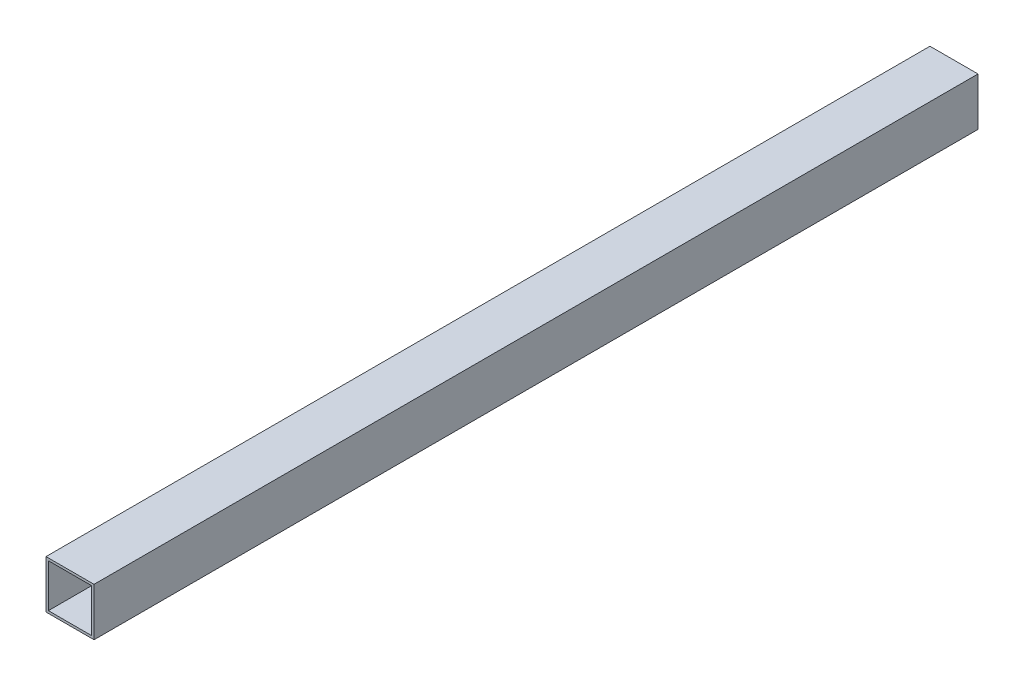
ISO-10303-21;
HEADER;
FILE_DESCRIPTION(('STEP AP214'),'2;1');
FILE_NAME('part.step','',(''),(''),'','','');
FILE_SCHEMA(('AUTOMOTIVE_DESIGN { 1 0 10303 214 1 1 1 1 }'));
ENDSEC;
DATA;
#1=APPLICATION_CONTEXT('core data for automotive mechanical design processes');
#2=APPLICATION_PROTOCOL_DEFINITION('international standard','automotive_design',2000,#1);
#3=PRODUCT_CONTEXT('',#1,'mechanical');
#4=PRODUCT('Part','Part','',(#3));
#5=PRODUCT_RELATED_PRODUCT_CATEGORY('part','',(#4));
#6=PRODUCT_DEFINITION_FORMATION('','',#4);
#7=PRODUCT_DEFINITION_CONTEXT('part definition',#1,'design');
#8=PRODUCT_DEFINITION('design','',#6,#7);
#9=PRODUCT_DEFINITION_SHAPE('','',#8);
#10=(LENGTH_UNIT() NAMED_UNIT(*) SI_UNIT(.MILLI.,.METRE.));
#11=(NAMED_UNIT(*) PLANE_ANGLE_UNIT() SI_UNIT($,.RADIAN.));
#12=(NAMED_UNIT(*) SI_UNIT($,.STERADIAN.) SOLID_ANGLE_UNIT());
#13=UNCERTAINTY_MEASURE_WITH_UNIT(LENGTH_MEASURE(1.E-05),#10,'distance_accuracy_value','');
#14=(GEOMETRIC_REPRESENTATION_CONTEXT(3) GLOBAL_UNCERTAINTY_ASSIGNED_CONTEXT((#13)) GLOBAL_UNIT_ASSIGNED_CONTEXT((#10,
#11,#12)) REPRESENTATION_CONTEXT('',''));
#15=CARTESIAN_POINT('',(0.,0.,0.));
#16=DIRECTION('',(0.,0.,1.));
#17=DIRECTION('',(1.,0.,0.));
#18=AXIS2_PLACEMENT_3D('',#15,#16,#17);
#19=CARTESIAN_POINT('',(0.,0.,920.));
#20=DIRECTION('',(0.,0.,-1.));
#21=DIRECTION('',(-1.,0.,0.));
#22=AXIS2_PLACEMENT_3D('',#19,#20,#21);
#23=PLANE('',#22);
#24=DIRECTION('',(0.,-1.,0.));
#25=VECTOR('',#24,1.);
#26=CARTESIAN_POINT('',(-50.,-50.,920.));
#27=LINE('',#26,#25);
#28=CARTESIAN_POINT('',(-50.,49.9999999999999,920.));
#29=VERTEX_POINT('',#28);
#30=CARTESIAN_POINT('',(-50.,-50.,920.));
#31=VERTEX_POINT('',#30);
#32=EDGE_CURVE('E137',#29,#31,#27,.T.);
#33=ORIENTED_EDGE('',*,*,#32,.T.);
#34=DIRECTION('',(1.,0.,0.));
#35=VECTOR('',#34,1.);
#36=CARTESIAN_POINT('',(-50.,-50.,920.));
#37=LINE('',#36,#35);
#38=CARTESIAN_POINT('',(50.,-50.,920.));
#39=VERTEX_POINT('',#38);
#40=EDGE_CURVE('E141',#31,#39,#37,.T.);
#41=ORIENTED_EDGE('',*,*,#40,.T.);
#42=DIRECTION('',(0.,1.,0.));
#43=VECTOR('',#42,1.);
#44=CARTESIAN_POINT('',(50.,-50.,920.));
#45=LINE('',#44,#43);
#46=CARTESIAN_POINT('',(49.9999999999999,49.9999999999999,920.));
#47=VERTEX_POINT('',#46);
#48=EDGE_CURVE('E148',#39,#47,#45,.T.);
#49=ORIENTED_EDGE('',*,*,#48,.T.);
#50=DIRECTION('',(-1.,0.,0.));
#51=VECTOR('',#50,1.);
#52=CARTESIAN_POINT('',(-50.,49.9999999999999,920.));
#53=LINE('',#52,#51);
#54=EDGE_CURVE('E146',#47,#29,#53,.T.);
#55=ORIENTED_EDGE('',*,*,#54,.T.);
#56=EDGE_LOOP('',(#33,#41,#49,#55));
#57=FACE_BOUND('',#56,.T.);
#58=DIRECTION('',(0.,-1.,0.));
#59=VECTOR('',#58,1.);
#60=CARTESIAN_POINT('',(-45.,-45.,920.));
#61=LINE('',#60,#59);
#62=CARTESIAN_POINT('',(-45.,44.9999999999999,920.));
#63=VERTEX_POINT('',#62);
#64=CARTESIAN_POINT('',(-45.,-45.,920.));
#65=VERTEX_POINT('',#64);
#66=EDGE_CURVE('E102',#63,#65,#61,.T.);
#67=ORIENTED_EDGE('',*,*,#66,.F.);
#68=DIRECTION('',(-1.,0.,0.));
#69=VECTOR('',#68,1.);
#70=CARTESIAN_POINT('',(-45.,44.9999999999999,920.));
#71=LINE('',#70,#69);
#72=CARTESIAN_POINT('',(45.,44.9999999999999,920.));
#73=VERTEX_POINT('',#72);
#74=EDGE_CURVE('E127',#73,#63,#71,.T.);
#75=ORIENTED_EDGE('',*,*,#74,.F.);
#76=DIRECTION('',(0.,1.,0.));
#77=VECTOR('',#76,1.);
#78=CARTESIAN_POINT('',(45.,-45.,920.));
#79=LINE('',#78,#77);
#80=CARTESIAN_POINT('',(45.,-45.,920.));
#81=VERTEX_POINT('',#80);
#82=EDGE_CURVE('E123',#81,#73,#79,.T.);
#83=ORIENTED_EDGE('',*,*,#82,.F.);
#84=DIRECTION('',(1.,0.,0.));
#85=VECTOR('',#84,1.);
#86=CARTESIAN_POINT('',(-45.,-45.,920.));
#87=LINE('',#86,#85);
#88=EDGE_CURVE('E115',#65,#81,#87,.T.);
#89=ORIENTED_EDGE('',*,*,#88,.F.);
#90=EDGE_LOOP('',(#67,#75,#83,#89));
#91=FACE_BOUND('',#90,.T.);
#92=ADVANCED_FACE('F39',(#57,#91),#23,.F.);
#93=CARTESIAN_POINT('',(0.,0.,-920.));
#94=DIRECTION('',(0.,0.,-1.));
#95=DIRECTION('',(-1.,0.,0.));
#96=AXIS2_PLACEMENT_3D('',#93,#94,#95);
#97=PLANE('',#96);
#98=DIRECTION('',(0.,-1.,0.));
#99=VECTOR('',#98,1.);
#100=CARTESIAN_POINT('',(-50.,-50.,-920.));
#101=LINE('',#100,#99);
#102=CARTESIAN_POINT('',(-50.,49.9999999999999,-920.));
#103=VERTEX_POINT('',#102);
#104=CARTESIAN_POINT('',(-50.,-50.,-920.));
#105=VERTEX_POINT('',#104);
#106=EDGE_CURVE('E118',#103,#105,#101,.T.);
#107=ORIENTED_EDGE('',*,*,#106,.F.);
#108=DIRECTION('',(-1.,0.,0.));
#109=VECTOR('',#108,1.);
#110=CARTESIAN_POINT('',(-50.,49.9999999999999,-920.));
#111=LINE('',#110,#109);
#112=CARTESIAN_POINT('',(49.9999999999999,49.9999999999999,-920.));
#113=VERTEX_POINT('',#112);
#114=EDGE_CURVE('E145',#113,#103,#111,.T.);
#115=ORIENTED_EDGE('',*,*,#114,.F.);
#116=DIRECTION('',(0.,1.,0.));
#117=VECTOR('',#116,1.);
#118=CARTESIAN_POINT('',(50.,-50.,-920.));
#119=LINE('',#118,#117);
#120=CARTESIAN_POINT('',(50.,-50.,-920.));
#121=VERTEX_POINT('',#120);
#122=EDGE_CURVE('E154',#121,#113,#119,.T.);
#123=ORIENTED_EDGE('',*,*,#122,.F.);
#124=DIRECTION('',(1.,0.,0.));
#125=VECTOR('',#124,1.);
#126=CARTESIAN_POINT('',(-50.,-50.,-920.));
#127=LINE('',#126,#125);
#128=EDGE_CURVE('E153',#105,#121,#127,.T.);
#129=ORIENTED_EDGE('',*,*,#128,.F.);
#130=EDGE_LOOP('',(#107,#115,#123,#129));
#131=FACE_BOUND('',#130,.T.);
#132=DIRECTION('',(-1.,0.,0.));
#133=VECTOR('',#132,1.);
#134=CARTESIAN_POINT('',(-45.,44.9999999999999,-920.));
#135=LINE('',#134,#133);
#136=CARTESIAN_POINT('',(45.,44.9999999999999,-920.));
#137=VERTEX_POINT('',#136);
#138=CARTESIAN_POINT('',(-45.,44.9999999999999,-920.));
#139=VERTEX_POINT('',#138);
#140=EDGE_CURVE('E114',#137,#139,#135,.T.);
#141=ORIENTED_EDGE('',*,*,#140,.T.);
#142=DIRECTION('',(0.,-1.,0.));
#143=VECTOR('',#142,1.);
#144=CARTESIAN_POINT('',(-45.,-45.,-920.));
#145=LINE('',#144,#143);
#146=CARTESIAN_POINT('',(-45.,-45.,-920.));
#147=VERTEX_POINT('',#146);
#148=EDGE_CURVE('E65',#139,#147,#145,.T.);
#149=ORIENTED_EDGE('',*,*,#148,.T.);
#150=DIRECTION('',(1.,0.,0.));
#151=VECTOR('',#150,1.);
#152=CARTESIAN_POINT('',(-45.,-45.,-920.));
#153=LINE('',#152,#151);
#154=CARTESIAN_POINT('',(45.,-45.,-920.));
#155=VERTEX_POINT('',#154);
#156=EDGE_CURVE('E116',#147,#155,#153,.T.);
#157=ORIENTED_EDGE('',*,*,#156,.T.);
#158=DIRECTION('',(0.,1.,0.));
#159=VECTOR('',#158,1.);
#160=CARTESIAN_POINT('',(45.,-45.,-920.));
#161=LINE('',#160,#159);
#162=EDGE_CURVE('E135',#155,#137,#161,.T.);
#163=ORIENTED_EDGE('',*,*,#162,.T.);
#164=EDGE_LOOP('',(#141,#149,#157,#163));
#165=FACE_BOUND('',#164,.T.);
#166=ADVANCED_FACE('F174',(#131,#165),#97,.T.);
#167=CARTESIAN_POINT('',(-50.,-50.,920.));
#168=DIRECTION('',(1.,0.,0.));
#169=DIRECTION('',(0.,0.,-1.));
#170=AXIS2_PLACEMENT_3D('',#167,#168,#169);
#171=PLANE('',#170);
#172=ORIENTED_EDGE('',*,*,#106,.T.);
#173=DIRECTION('',(0.,0.,-1.));
#174=VECTOR('',#173,1.);
#175=CARTESIAN_POINT('',(-50.,-50.,920.));
#176=LINE('',#175,#174);
#177=EDGE_CURVE('E11',#31,#105,#176,.T.);
#178=ORIENTED_EDGE('',*,*,#177,.F.);
#179=ORIENTED_EDGE('',*,*,#32,.F.);
#180=DIRECTION('',(0.,0.,-1.));
#181=VECTOR('',#180,1.);
#182=CARTESIAN_POINT('',(-50.,49.9999999999999,920.));
#183=LINE('',#182,#181);
#184=EDGE_CURVE('E147',#29,#103,#183,.T.);
#185=ORIENTED_EDGE('',*,*,#184,.T.);
#186=EDGE_LOOP('',(#172,#178,#179,#185));
#187=FACE_BOUND('',#186,.T.);
#188=ADVANCED_FACE('F41',(#187),#171,.F.);
#189=CARTESIAN_POINT('',(-50.,-50.,920.));
#190=DIRECTION('',(0.,1.,0.));
#191=DIRECTION('',(0.,0.,1.));
#192=AXIS2_PLACEMENT_3D('',#189,#190,#191);
#193=PLANE('',#192);
#194=ORIENTED_EDGE('',*,*,#128,.T.);
#195=DIRECTION('',(0.,0.,-1.));
#196=VECTOR('',#195,1.);
#197=CARTESIAN_POINT('',(50.,-50.,920.));
#198=LINE('',#197,#196);
#199=EDGE_CURVE('E50',#39,#121,#198,.T.);
#200=ORIENTED_EDGE('',*,*,#199,.F.);
#201=ORIENTED_EDGE('',*,*,#40,.F.);
#202=ORIENTED_EDGE('',*,*,#177,.T.);
#203=EDGE_LOOP('',(#194,#200,#201,#202));
#204=FACE_BOUND('',#203,.T.);
#205=ADVANCED_FACE('F181',(#204),#193,.F.);
#206=CARTESIAN_POINT('',(50.,-50.,920.));
#207=DIRECTION('',(-1.,0.,0.));
#208=DIRECTION('',(0.,-1.,0.));
#209=AXIS2_PLACEMENT_3D('',#206,#207,#208);
#210=PLANE('',#209);
#211=ORIENTED_EDGE('',*,*,#122,.T.);
#212=DIRECTION('',(0.,0.,-1.));
#213=VECTOR('',#212,1.);
#214=CARTESIAN_POINT('',(49.9999999999999,49.9999999999999,920.));
#215=LINE('',#214,#213);
#216=EDGE_CURVE('E159',#47,#113,#215,.T.);
#217=ORIENTED_EDGE('',*,*,#216,.F.);
#218=ORIENTED_EDGE('',*,*,#48,.F.);
#219=ORIENTED_EDGE('',*,*,#199,.T.);
#220=EDGE_LOOP('',(#211,#217,#218,#219));
#221=FACE_BOUND('',#220,.T.);
#222=ADVANCED_FACE('F170',(#221),#210,.F.);
#223=CARTESIAN_POINT('',(-50.,49.9999999999999,920.));
#224=DIRECTION('',(0.,-1.,0.));
#225=DIRECTION('',(0.,0.,-1.));
#226=AXIS2_PLACEMENT_3D('',#223,#224,#225);
#227=PLANE('',#226);
#228=ORIENTED_EDGE('',*,*,#114,.T.);
#229=ORIENTED_EDGE('',*,*,#184,.F.);
#230=ORIENTED_EDGE('',*,*,#54,.F.);
#231=ORIENTED_EDGE('',*,*,#216,.T.);
#232=EDGE_LOOP('',(#228,#229,#230,#231));
#233=FACE_BOUND('',#232,.T.);
#234=ADVANCED_FACE('F180',(#233),#227,.F.);
#235=CARTESIAN_POINT('',(-45.,-45.,920.));
#236=DIRECTION('',(1.,0.,0.));
#237=DIRECTION('',(0.,0.,-1.));
#238=AXIS2_PLACEMENT_3D('',#235,#236,#237);
#239=PLANE('',#238);
#240=ORIENTED_EDGE('',*,*,#148,.F.);
#241=DIRECTION('',(0.,0.,-1.));
#242=VECTOR('',#241,1.);
#243=CARTESIAN_POINT('',(-45.,44.9999999999999,920.));
#244=LINE('',#243,#242);
#245=EDGE_CURVE('E107',#63,#139,#244,.T.);
#246=ORIENTED_EDGE('',*,*,#245,.F.);
#247=ORIENTED_EDGE('',*,*,#66,.T.);
#248=DIRECTION('',(0.,0.,-1.));
#249=VECTOR('',#248,1.);
#250=CARTESIAN_POINT('',(-45.,-45.,920.));
#251=LINE('',#250,#249);
#252=EDGE_CURVE('E110',#65,#147,#251,.T.);
#253=ORIENTED_EDGE('',*,*,#252,.T.);
#254=EDGE_LOOP('',(#240,#246,#247,#253));
#255=FACE_BOUND('',#254,.T.);
#256=ADVANCED_FACE('F106',(#255),#239,.T.);
#257=CARTESIAN_POINT('',(-45.,-45.,920.));
#258=DIRECTION('',(0.,1.,0.));
#259=DIRECTION('',(0.,0.,1.));
#260=AXIS2_PLACEMENT_3D('',#257,#258,#259);
#261=PLANE('',#260);
#262=ORIENTED_EDGE('',*,*,#156,.F.);
#263=ORIENTED_EDGE('',*,*,#252,.F.);
#264=ORIENTED_EDGE('',*,*,#88,.T.);
#265=DIRECTION('',(0.,0.,-1.));
#266=VECTOR('',#265,1.);
#267=CARTESIAN_POINT('',(45.,-45.,920.));
#268=LINE('',#267,#266);
#269=EDGE_CURVE('E121',#81,#155,#268,.T.);
#270=ORIENTED_EDGE('',*,*,#269,.T.);
#271=EDGE_LOOP('',(#262,#263,#264,#270));
#272=FACE_BOUND('',#271,.T.);
#273=ADVANCED_FACE('F117',(#272),#261,.T.);
#274=CARTESIAN_POINT('',(45.,-45.,920.));
#275=DIRECTION('',(-1.,0.,0.));
#276=DIRECTION('',(0.,-1.,0.));
#277=AXIS2_PLACEMENT_3D('',#274,#275,#276);
#278=PLANE('',#277);
#279=ORIENTED_EDGE('',*,*,#162,.F.);
#280=ORIENTED_EDGE('',*,*,#269,.F.);
#281=ORIENTED_EDGE('',*,*,#82,.T.);
#282=DIRECTION('',(0.,0.,-1.));
#283=VECTOR('',#282,1.);
#284=CARTESIAN_POINT('',(45.,44.9999999999999,920.));
#285=LINE('',#284,#283);
#286=EDGE_CURVE('E53',#73,#137,#285,.T.);
#287=ORIENTED_EDGE('',*,*,#286,.T.);
#288=EDGE_LOOP('',(#279,#280,#281,#287));
#289=FACE_BOUND('',#288,.T.);
#290=ADVANCED_FACE('F206',(#289),#278,.T.);
#291=CARTESIAN_POINT('',(-45.,44.9999999999999,920.));
#292=DIRECTION('',(0.,-1.,0.));
#293=DIRECTION('',(0.,0.,-1.));
#294=AXIS2_PLACEMENT_3D('',#291,#292,#293);
#295=PLANE('',#294);
#296=ORIENTED_EDGE('',*,*,#140,.F.);
#297=ORIENTED_EDGE('',*,*,#286,.F.);
#298=ORIENTED_EDGE('',*,*,#74,.T.);
#299=ORIENTED_EDGE('',*,*,#245,.T.);
#300=EDGE_LOOP('',(#296,#297,#298,#299));
#301=FACE_BOUND('',#300,.T.);
#302=ADVANCED_FACE('F209',(#301),#295,.T.);
#303=CLOSED_SHELL('',(#92,#166,#188,#205,#222,#234,#256,#273,#290,#302));
#304=MANIFOLD_SOLID_BREP('B2',#303);
#305=ADVANCED_BREP_SHAPE_REPRESENTATION('',(#18,#304),#14);
#306=SHAPE_DEFINITION_REPRESENTATION(#9,#305);
ENDSEC;
END-ISO-10303-21;
